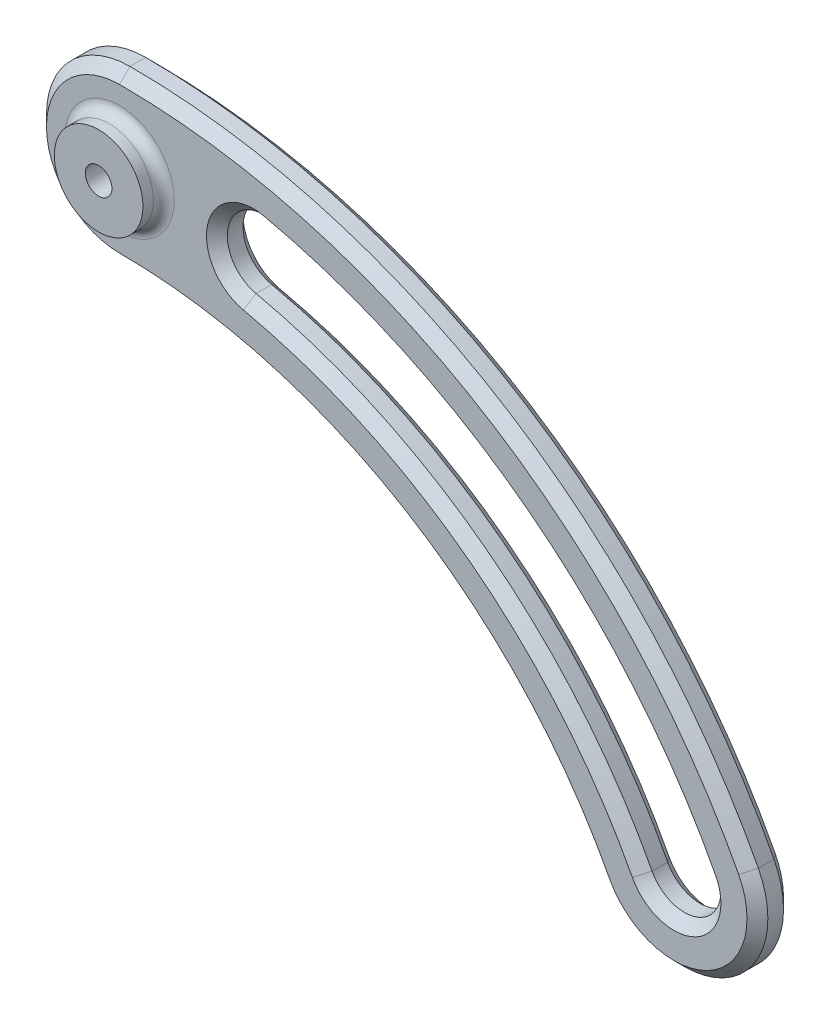
ISO-10303-21;
HEADER;
FILE_DESCRIPTION(('STEP AP214'),'2;1');
FILE_NAME('part.step','',(''),(''),'','','');
FILE_SCHEMA(('AUTOMOTIVE_DESIGN { 1 0 10303 214 1 1 1 1 }'));
ENDSEC;
DATA;
#1=APPLICATION_CONTEXT('core data for automotive mechanical design processes');
#2=APPLICATION_PROTOCOL_DEFINITION('international standard','automotive_design',2000,#1);
#3=PRODUCT_CONTEXT('',#1,'mechanical');
#4=PRODUCT('Part','Part','',(#3));
#5=PRODUCT_RELATED_PRODUCT_CATEGORY('part','',(#4));
#6=PRODUCT_DEFINITION_FORMATION('','',#4);
#7=PRODUCT_DEFINITION_CONTEXT('part definition',#1,'design');
#8=PRODUCT_DEFINITION('design','',#6,#7);
#9=PRODUCT_DEFINITION_SHAPE('','',#8);
#10=(LENGTH_UNIT() NAMED_UNIT(*) SI_UNIT(.MILLI.,.METRE.));
#11=(NAMED_UNIT(*) PLANE_ANGLE_UNIT() SI_UNIT($,.RADIAN.));
#12=(NAMED_UNIT(*) SI_UNIT($,.STERADIAN.) SOLID_ANGLE_UNIT());
#13=UNCERTAINTY_MEASURE_WITH_UNIT(LENGTH_MEASURE(1.E-05),#10,'distance_accuracy_value','');
#14=(GEOMETRIC_REPRESENTATION_CONTEXT(3) GLOBAL_UNCERTAINTY_ASSIGNED_CONTEXT((#13)) GLOBAL_UNIT_ASSIGNED_CONTEXT((#10,
#11,#12)) REPRESENTATION_CONTEXT('',''));
#15=CARTESIAN_POINT('',(0.,0.,0.));
#16=DIRECTION('',(0.,0.,1.));
#17=DIRECTION('',(1.,0.,0.));
#18=AXIS2_PLACEMENT_3D('',#15,#16,#17);
#19=CARTESIAN_POINT('',(0.,0.,7.));
#20=DIRECTION('',(0.,0.,1.));
#21=DIRECTION('',(1.,0.,0.));
#22=AXIS2_PLACEMENT_3D('',#19,#20,#21);
#23=PLANE('',#22);
#24=CARTESIAN_POINT('',(0.,0.,7.));
#25=DIRECTION('',(0.,0.,1.));
#26=DIRECTION('',(1.,0.,0.));
#27=AXIS2_PLACEMENT_3D('',#24,#25,#26);
#28=CIRCLE('',#27,10.5);
#29=CARTESIAN_POINT('',(10.5,0.,7.));
#30=VERTEX_POINT('',#29);
#31=EDGE_CURVE('E12',#30,#30,#28,.F.);
#32=ORIENTED_EDGE('',*,*,#31,.T.);
#33=EDGE_LOOP('',(#32));
#34=FACE_BOUND('',#33,.T.);
#35=CARTESIAN_POINT('',(0.,-120.,7.));
#36=DIRECTION('',(0.,0.,1.));
#37=DIRECTION('',(1.,0.,0.));
#38=AXIS2_PLACEMENT_3D('',#35,#36,#37);
#39=CIRCLE('',#38,134.);
#40=CARTESIAN_POINT('',(118.702367557929,-57.82486078711,7.));
#41=VERTEX_POINT('',#40);
#42=CARTESIAN_POINT('',(0.,13.9999999999999,7.));
#43=VERTEX_POINT('',#42);
#44=EDGE_CURVE('E270',#41,#43,#39,.T.);
#45=ORIENTED_EDGE('',*,*,#44,.T.);
#46=CARTESIAN_POINT('',(0.,0.,7.));
#47=DIRECTION('',(0.,0.,1.));
#48=DIRECTION('',(1.,0.,0.));
#49=AXIS2_PLACEMENT_3D('',#46,#47,#48);
#50=CIRCLE('',#49,13.9999999999999);
#51=CARTESIAN_POINT('',(0.,-13.9999999999999,7.));
#52=VERTEX_POINT('',#51);
#53=EDGE_CURVE('E274',#43,#52,#50,.T.);
#54=ORIENTED_EDGE('',*,*,#53,.T.);
#55=CARTESIAN_POINT('',(0.,-120.,7.));
#56=DIRECTION('',(0.,0.,1.));
#57=DIRECTION('',(1.,0.,0.));
#58=AXIS2_PLACEMENT_3D('',#55,#56,#57);
#59=CIRCLE('',#58,106.);
#60=CARTESIAN_POINT('',(93.8988877697053,-70.8166809211466,7.));
#61=VERTEX_POINT('',#60);
#62=EDGE_CURVE('E272',#52,#61,#59,.F.);
#63=ORIENTED_EDGE('',*,*,#62,.T.);
#64=CARTESIAN_POINT('',(106.300627663817,-64.3207708541283,7.));
#65=DIRECTION('',(0.,0.,1.));
#66=DIRECTION('',(1.,0.,0.));
#67=AXIS2_PLACEMENT_3D('',#64,#65,#66);
#68=CIRCLE('',#67,13.9999999999999);
#69=EDGE_CURVE('E268',#61,#41,#68,.T.);
#70=ORIENTED_EDGE('',*,*,#69,.T.);
#71=EDGE_LOOP('',(#45,#54,#63,#70));
#72=FACE_BOUND('',#71,.T.);
#73=CARTESIAN_POINT('',(106.300627663817,-64.3207708541283,7.));
#74=DIRECTION('',(0.,0.,1.));
#75=DIRECTION('',(1.,0.,0.));
#76=AXIS2_PLACEMENT_3D('',#73,#74,#75);
#77=CIRCLE('',#76,8.99999999999999);
#78=CARTESIAN_POINT('',(114.273174738604,-60.1448286681879,7.));
#79=VERTEX_POINT('',#78);
#80=CARTESIAN_POINT('',(98.328080589031,-68.4967130400687,7.));
#81=VERTEX_POINT('',#80);
#82=EDGE_CURVE('E165',#79,#81,#77,.F.);
#83=ORIENTED_EDGE('',*,*,#82,.T.);
#84=CARTESIAN_POINT('',(0.,-120.,7.));
#85=DIRECTION('',(0.,0.,1.));
#86=DIRECTION('',(1.,0.,0.));
#87=AXIS2_PLACEMENT_3D('',#84,#85,#86);
#88=CIRCLE('',#87,111.);
#89=CARTESIAN_POINT('',(23.7502651088709,-11.5706455462435,7.));
#90=VERTEX_POINT('',#89);
#91=EDGE_CURVE('E161',#81,#90,#88,.T.);
#92=ORIENTED_EDGE('',*,*,#91,.T.);
#93=CARTESIAN_POINT('',(25.6759622798604,-2.77907626620924,7.));
#94=DIRECTION('',(0.,0.,1.));
#95=DIRECTION('',(1.,0.,0.));
#96=AXIS2_PLACEMENT_3D('',#93,#94,#95);
#97=CIRCLE('',#96,9.);
#98=CARTESIAN_POINT('',(27.6016594508499,6.01249301382506,7.));
#99=VERTEX_POINT('',#98);
#100=EDGE_CURVE('E156',#90,#99,#97,.F.);
#101=ORIENTED_EDGE('',*,*,#100,.T.);
#102=CARTESIAN_POINT('',(0.,-120.,7.));
#103=DIRECTION('',(0.,0.,1.));
#104=DIRECTION('',(1.,0.,0.));
#105=AXIS2_PLACEMENT_3D('',#102,#103,#104);
#106=CIRCLE('',#105,129.);
#107=EDGE_CURVE('E158',#99,#79,#106,.F.);
#108=ORIENTED_EDGE('',*,*,#107,.T.);
#109=EDGE_LOOP('',(#83,#92,#101,#108));
#110=FACE_BOUND('',#109,.T.);
#111=ADVANCED_FACE('F40',(#34,#72,#110),#23,.T.);
#112=CARTESIAN_POINT('',(0.,-120.,7.));
#113=DIRECTION('',(0.,0.,-1.));
#114=DIRECTION('',(-1.,0.,0.));
#115=AXIS2_PLACEMENT_3D('',#112,#113,#114);
#116=CYLINDRICAL_SURFACE('',#115,127.);
#117=DIRECTION('',(0.,0.,-1.));
#118=VECTOR('',#117,1.);
#119=CARTESIAN_POINT('',(27.1737267461856,4.05881095159521,7.));
#120=LINE('',#119,#118);
#121=CARTESIAN_POINT('',(27.1737267461856,4.05881095159521,5.));
#122=VERTEX_POINT('',#121);
#123=CARTESIAN_POINT('',(27.1737267461856,4.05881095159521,2.00000000000003));
#124=VERTEX_POINT('',#123);
#125=EDGE_CURVE('E247',#122,#124,#120,.T.);
#126=ORIENTED_EDGE('',*,*,#125,.T.);
#127=CARTESIAN_POINT('',(0.,-120.,2.00000000000003));
#128=DIRECTION('',(0.,0.,1.));
#129=DIRECTION('',(1.,0.,0.));
#130=AXIS2_PLACEMENT_3D('',#127,#128,#129);
#131=CIRCLE('',#130,127.);
#132=CARTESIAN_POINT('',(112.501497610873,-61.0728158206191,2.00000000000003));
#133=VERTEX_POINT('',#132);
#134=EDGE_CURVE('E56',#124,#133,#131,.F.);
#135=ORIENTED_EDGE('',*,*,#134,.T.);
#136=DIRECTION('',(0.,0.,-1.));
#137=VECTOR('',#136,1.);
#138=CARTESIAN_POINT('',(112.501497610873,-61.0728158206191,7.));
#139=LINE('',#138,#137);
#140=CARTESIAN_POINT('',(112.501497610873,-61.0728158206191,5.));
#141=VERTEX_POINT('',#140);
#142=EDGE_CURVE('E176',#141,#133,#139,.T.);
#143=ORIENTED_EDGE('',*,*,#142,.F.);
#144=CARTESIAN_POINT('',(0.,-120.,5.));
#145=DIRECTION('',(0.,0.,1.));
#146=DIRECTION('',(1.,0.,0.));
#147=AXIS2_PLACEMENT_3D('',#144,#145,#146);
#148=CIRCLE('',#147,127.);
#149=EDGE_CURVE('E322',#141,#122,#148,.T.);
#150=ORIENTED_EDGE('',*,*,#149,.T.);
#151=EDGE_LOOP('',(#126,#135,#143,#150));
#152=FACE_BOUND('',#151,.T.);
#153=ADVANCED_FACE('F324',(#152),#116,.F.);
#154=CARTESIAN_POINT('',(106.300627663817,-64.3207708541283,7.));
#155=DIRECTION('',(0.,0.,-1.));
#156=DIRECTION('',(-1.,0.,0.));
#157=AXIS2_PLACEMENT_3D('',#154,#155,#156);
#158=CYLINDRICAL_SURFACE('',#157,6.99999999999999);
#159=ORIENTED_EDGE('',*,*,#142,.T.);
#160=CARTESIAN_POINT('',(106.300627663817,-64.3207708541283,2.00000000000003));
#161=DIRECTION('',(0.,0.,1.));
#162=DIRECTION('',(1.,0.,0.));
#163=AXIS2_PLACEMENT_3D('',#160,#161,#162);
#164=CIRCLE('',#163,6.99999999999999);
#165=CARTESIAN_POINT('',(100.099757716761,-67.5687258876375,2.00000000000003));
#166=VERTEX_POINT('',#165);
#167=EDGE_CURVE('E189',#133,#166,#164,.F.);
#168=ORIENTED_EDGE('',*,*,#167,.T.);
#169=DIRECTION('',(0.,0.,-1.));
#170=VECTOR('',#169,1.);
#171=CARTESIAN_POINT('',(100.099757716761,-67.5687258876375,7.));
#172=LINE('',#171,#170);
#173=CARTESIAN_POINT('',(100.099757716761,-67.5687258876375,5.));
#174=VERTEX_POINT('',#173);
#175=EDGE_CURVE('E253',#174,#166,#172,.T.);
#176=ORIENTED_EDGE('',*,*,#175,.F.);
#177=CARTESIAN_POINT('',(106.300627663817,-64.3207708541283,5.));
#178=DIRECTION('',(0.,0.,1.));
#179=DIRECTION('',(1.,0.,0.));
#180=AXIS2_PLACEMENT_3D('',#177,#178,#179);
#181=CIRCLE('',#180,6.99999999999999);
#182=EDGE_CURVE('E63',#174,#141,#181,.T.);
#183=ORIENTED_EDGE('',*,*,#182,.T.);
#184=EDGE_LOOP('',(#159,#168,#176,#183));
#185=FACE_BOUND('',#184,.T.);
#186=ADVANCED_FACE('F366',(#185),#158,.F.);
#187=CARTESIAN_POINT('',(0.,-120.,7.));
#188=DIRECTION('',(0.,0.,-1.));
#189=DIRECTION('',(-1.,0.,0.));
#190=AXIS2_PLACEMENT_3D('',#187,#188,#189);
#191=CYLINDRICAL_SURFACE('',#190,113.);
#192=ORIENTED_EDGE('',*,*,#175,.T.);
#193=CARTESIAN_POINT('',(0.,-120.,2.00000000000003));
#194=DIRECTION('',(0.,0.,1.));
#195=DIRECTION('',(1.,0.,0.));
#196=AXIS2_PLACEMENT_3D('',#193,#194,#195);
#197=CIRCLE('',#196,113.);
#198=CARTESIAN_POINT('',(24.1781978135352,-9.6169634840137,2.00000000000003));
#199=VERTEX_POINT('',#198);
#200=EDGE_CURVE('E320',#166,#199,#197,.T.);
#201=ORIENTED_EDGE('',*,*,#200,.T.);
#202=DIRECTION('',(0.,0.,-1.));
#203=VECTOR('',#202,1.);
#204=CARTESIAN_POINT('',(24.1781978135352,-9.6169634840137,7.));
#205=LINE('',#204,#203);
#206=CARTESIAN_POINT('',(24.1781978135352,-9.6169634840137,5.));
#207=VERTEX_POINT('',#206);
#208=EDGE_CURVE('E249',#207,#199,#205,.T.);
#209=ORIENTED_EDGE('',*,*,#208,.F.);
#210=CARTESIAN_POINT('',(0.,-120.,5.));
#211=DIRECTION('',(0.,0.,1.));
#212=DIRECTION('',(1.,0.,0.));
#213=AXIS2_PLACEMENT_3D('',#210,#211,#212);
#214=CIRCLE('',#213,113.);
#215=EDGE_CURVE('E317',#207,#174,#214,.F.);
#216=ORIENTED_EDGE('',*,*,#215,.T.);
#217=EDGE_LOOP('',(#192,#201,#209,#216));
#218=FACE_BOUND('',#217,.T.);
#219=ADVANCED_FACE('F385',(#218),#191,.T.);
#220=CARTESIAN_POINT('',(0.,-120.,7.));
#221=DIRECTION('',(0.,0.,-1.));
#222=DIRECTION('',(-1.,0.,0.));
#223=AXIS2_PLACEMENT_3D('',#220,#221,#222);
#224=CYLINDRICAL_SURFACE('',#223,104.);
#225=DIRECTION('',(0.,0.,-1.));
#226=VECTOR('',#225,1.);
#227=CARTESIAN_POINT('',(92.127210641975,-71.7446680735778,7.));
#228=LINE('',#227,#226);
#229=CARTESIAN_POINT('',(92.127210641975,-71.7446680735778,4.99999999999997));
#230=VERTEX_POINT('',#229);
#231=CARTESIAN_POINT('',(92.127210641975,-71.7446680735778,2.00000000000002));
#232=VERTEX_POINT('',#231);
#233=EDGE_CURVE('E250',#230,#232,#228,.T.);
#234=ORIENTED_EDGE('',*,*,#233,.F.);
#235=CARTESIAN_POINT('',(0.,-120.,4.99999999999997));
#236=DIRECTION('',(0.,0.,1.));
#237=DIRECTION('',(1.,0.,0.));
#238=AXIS2_PLACEMENT_3D('',#235,#236,#237);
#239=CIRCLE('',#238,104.);
#240=CARTESIAN_POINT('',(0.,-16.,4.99999999999997));
#241=VERTEX_POINT('',#240);
#242=EDGE_CURVE('E285',#230,#241,#239,.T.);
#243=ORIENTED_EDGE('',*,*,#242,.T.);
#244=DIRECTION('',(0.,0.,-1.));
#245=VECTOR('',#244,1.);
#246=CARTESIAN_POINT('',(0.,-16.,7.));
#247=LINE('',#246,#245);
#248=CARTESIAN_POINT('',(0.,-16.,2.00000000000002));
#249=VERTEX_POINT('',#248);
#250=EDGE_CURVE('E246',#241,#249,#247,.T.);
#251=ORIENTED_EDGE('',*,*,#250,.T.);
#252=CARTESIAN_POINT('',(0.,-120.,2.00000000000002));
#253=DIRECTION('',(0.,0.,1.));
#254=DIRECTION('',(1.,0.,0.));
#255=AXIS2_PLACEMENT_3D('',#252,#253,#254);
#256=CIRCLE('',#255,104.);
#257=EDGE_CURVE('E283',#249,#232,#256,.F.);
#258=ORIENTED_EDGE('',*,*,#257,.T.);
#259=EDGE_LOOP('',(#234,#243,#251,#258));
#260=FACE_BOUND('',#259,.T.);
#261=ADVANCED_FACE('F388',(#260),#224,.F.);
#262=CARTESIAN_POINT('',(106.300627663817,-64.3207708541283,7.));
#263=DIRECTION('',(0.,0.,-1.));
#264=DIRECTION('',(-1.,0.,0.));
#265=AXIS2_PLACEMENT_3D('',#262,#263,#264);
#266=CYLINDRICAL_SURFACE('',#265,16.);
#267=DIRECTION('',(0.,0.,-1.));
#268=VECTOR('',#267,1.);
#269=CARTESIAN_POINT('',(120.47404468566,-56.8968736346787,7.));
#270=LINE('',#269,#268);
#271=CARTESIAN_POINT('',(120.47404468566,-56.8968736346787,4.99999999999997));
#272=VERTEX_POINT('',#271);
#273=CARTESIAN_POINT('',(120.47404468566,-56.8968736346787,2.00000000000002));
#274=VERTEX_POINT('',#273);
#275=EDGE_CURVE('E261',#272,#274,#270,.T.);
#276=ORIENTED_EDGE('',*,*,#275,.F.);
#277=CARTESIAN_POINT('',(106.300627663817,-64.3207708541283,4.99999999999997));
#278=DIRECTION('',(0.,0.,1.));
#279=DIRECTION('',(1.,0.,0.));
#280=AXIS2_PLACEMENT_3D('',#277,#278,#279);
#281=CIRCLE('',#280,16.);
#282=EDGE_CURVE('E293',#272,#230,#281,.F.);
#283=ORIENTED_EDGE('',*,*,#282,.T.);
#284=ORIENTED_EDGE('',*,*,#233,.T.);
#285=CARTESIAN_POINT('',(106.300627663817,-64.3207708541283,2.00000000000002));
#286=DIRECTION('',(0.,0.,1.));
#287=DIRECTION('',(1.,0.,0.));
#288=AXIS2_PLACEMENT_3D('',#285,#286,#287);
#289=CIRCLE('',#288,16.);
#290=EDGE_CURVE('E291',#232,#274,#289,.T.);
#291=ORIENTED_EDGE('',*,*,#290,.T.);
#292=EDGE_LOOP('',(#276,#283,#284,#291));
#293=FACE_BOUND('',#292,.T.);
#294=ADVANCED_FACE('F397',(#293),#266,.T.);
#295=CARTESIAN_POINT('',(0.,-120.,7.));
#296=DIRECTION('',(0.,0.,-1.));
#297=DIRECTION('',(-1.,0.,0.));
#298=AXIS2_PLACEMENT_3D('',#295,#296,#297);
#299=CYLINDRICAL_SURFACE('',#298,136.);
#300=DIRECTION('',(0.,0.,-1.));
#301=VECTOR('',#300,1.);
#302=CARTESIAN_POINT('',(0.,16.,7.));
#303=LINE('',#302,#301);
#304=CARTESIAN_POINT('',(0.,16.,4.99999999999997));
#305=VERTEX_POINT('',#304);
#306=CARTESIAN_POINT('',(0.,16.,2.00000000000002));
#307=VERTEX_POINT('',#306);
#308=EDGE_CURVE('E258',#305,#307,#303,.T.);
#309=ORIENTED_EDGE('',*,*,#308,.F.);
#310=CARTESIAN_POINT('',(0.,-120.,4.99999999999997));
#311=DIRECTION('',(0.,0.,1.));
#312=DIRECTION('',(1.,0.,0.));
#313=AXIS2_PLACEMENT_3D('',#310,#311,#312);
#314=CIRCLE('',#313,136.);
#315=EDGE_CURVE('E289',#305,#272,#314,.F.);
#316=ORIENTED_EDGE('',*,*,#315,.T.);
#317=ORIENTED_EDGE('',*,*,#275,.T.);
#318=CARTESIAN_POINT('',(0.,-120.,2.00000000000002));
#319=DIRECTION('',(0.,0.,1.));
#320=DIRECTION('',(1.,0.,0.));
#321=AXIS2_PLACEMENT_3D('',#318,#319,#320);
#322=CIRCLE('',#321,136.);
#323=EDGE_CURVE('E287',#274,#307,#322,.T.);
#324=ORIENTED_EDGE('',*,*,#323,.T.);
#325=EDGE_LOOP('',(#309,#316,#317,#324));
#326=FACE_BOUND('',#325,.T.);
#327=ADVANCED_FACE('F384',(#326),#299,.T.);
#328=CARTESIAN_POINT('',(25.6759622798604,-2.77907626620924,7.));
#329=DIRECTION('',(0.,0.,-1.));
#330=DIRECTION('',(-1.,0.,0.));
#331=AXIS2_PLACEMENT_3D('',#328,#329,#330);
#332=CYLINDRICAL_SURFACE('',#331,7.);
#333=ORIENTED_EDGE('',*,*,#208,.T.);
#334=CARTESIAN_POINT('',(25.6759622798604,-2.77907626620924,2.00000000000003));
#335=DIRECTION('',(0.,0.,1.));
#336=DIRECTION('',(1.,0.,0.));
#337=AXIS2_PLACEMENT_3D('',#334,#335,#336);
#338=CIRCLE('',#337,7.);
#339=EDGE_CURVE('E314',#199,#124,#338,.F.);
#340=ORIENTED_EDGE('',*,*,#339,.T.);
#341=ORIENTED_EDGE('',*,*,#125,.F.);
#342=CARTESIAN_POINT('',(25.6759622798604,-2.77907626620924,5.));
#343=DIRECTION('',(0.,0.,1.));
#344=DIRECTION('',(1.,0.,0.));
#345=AXIS2_PLACEMENT_3D('',#342,#343,#344);
#346=CIRCLE('',#345,7.);
#347=EDGE_CURVE('E179',#122,#207,#346,.T.);
#348=ORIENTED_EDGE('',*,*,#347,.T.);
#349=EDGE_LOOP('',(#333,#340,#341,#348));
#350=FACE_BOUND('',#349,.T.);
#351=ADVANCED_FACE('F326',(#350),#332,.F.);
#352=CARTESIAN_POINT('',(0.,0.,7.));
#353=DIRECTION('',(0.,0.,-1.));
#354=DIRECTION('',(-1.,0.,0.));
#355=AXIS2_PLACEMENT_3D('',#352,#353,#354);
#356=CYLINDRICAL_SURFACE('',#355,16.);
#357=ORIENTED_EDGE('',*,*,#250,.F.);
#358=CARTESIAN_POINT('',(0.,0.,4.99999999999997));
#359=DIRECTION('',(0.,0.,1.));
#360=DIRECTION('',(1.,0.,0.));
#361=AXIS2_PLACEMENT_3D('',#358,#359,#360);
#362=CIRCLE('',#361,16.);
#363=EDGE_CURVE('E280',#241,#305,#362,.F.);
#364=ORIENTED_EDGE('',*,*,#363,.T.);
#365=ORIENTED_EDGE('',*,*,#308,.T.);
#366=CARTESIAN_POINT('',(0.,0.,2.00000000000002));
#367=DIRECTION('',(0.,0.,1.));
#368=DIRECTION('',(1.,0.,0.));
#369=AXIS2_PLACEMENT_3D('',#366,#367,#368);
#370=CIRCLE('',#369,16.);
#371=EDGE_CURVE('E277',#307,#249,#370,.T.);
#372=ORIENTED_EDGE('',*,*,#371,.T.);
#373=EDGE_LOOP('',(#357,#364,#365,#372));
#374=FACE_BOUND('',#373,.T.);
#375=ADVANCED_FACE('F380',(#374),#356,.T.);
#376=CARTESIAN_POINT('',(0.,0.,7.));
#377=DIRECTION('',(0.,0.,-1.));
#378=DIRECTION('',(-1.,0.,0.));
#379=AXIS2_PLACEMENT_3D('',#376,#377,#378);
#380=CYLINDRICAL_SURFACE('',#379,2.55);
#381=CARTESIAN_POINT('',(0.,0.,2.));
#382=DIRECTION('',(0.,0.,1.));
#383=DIRECTION('',(1.,0.,0.));
#384=AXIS2_PLACEMENT_3D('',#381,#382,#383);
#385=CIRCLE('',#384,2.55);
#386=CARTESIAN_POINT('',(2.55,0.,2.));
#387=VERTEX_POINT('',#386);
#388=EDGE_CURVE('E44',#387,#387,#385,.T.);
#389=ORIENTED_EDGE('',*,*,#388,.F.);
#390=EDGE_LOOP('',(#389));
#391=FACE_BOUND('',#390,.T.);
#392=CARTESIAN_POINT('',(0.,0.,11.));
#393=DIRECTION('',(0.,0.,1.));
#394=DIRECTION('',(1.,0.,0.));
#395=AXIS2_PLACEMENT_3D('',#392,#393,#394);
#396=CIRCLE('',#395,2.55);
#397=CARTESIAN_POINT('',(2.55,0.,11.));
#398=VERTEX_POINT('',#397);
#399=EDGE_CURVE('E209',#398,#398,#396,.T.);
#400=ORIENTED_EDGE('',*,*,#399,.T.);
#401=EDGE_LOOP('',(#400));
#402=FACE_BOUND('',#401,.T.);
#403=ADVANCED_FACE('F376',(#391,#402),#380,.F.);
#404=CARTESIAN_POINT('',(0.,0.,0.));
#405=DIRECTION('',(0.,0.,1.));
#406=DIRECTION('',(1.,0.,0.));
#407=AXIS2_PLACEMENT_3D('',#404,#405,#406);
#408=PLANE('',#407);
#409=CARTESIAN_POINT('',(0.,0.,0.));
#410=DIRECTION('',(0.,0.,1.));
#411=DIRECTION('',(1.,0.,0.));
#412=AXIS2_PLACEMENT_3D('',#409,#410,#411);
#413=CIRCLE('',#412,5.25);
#414=CARTESIAN_POINT('',(5.25,0.,0.));
#415=VERTEX_POINT('',#414);
#416=EDGE_CURVE('E230',#415,#415,#413,.F.);
#417=ORIENTED_EDGE('',*,*,#416,.F.);
#418=EDGE_LOOP('',(#417));
#419=FACE_BOUND('',#418,.T.);
#420=CARTESIAN_POINT('',(0.,-120.,0.));
#421=DIRECTION('',(0.,0.,1.));
#422=DIRECTION('',(1.,0.,0.));
#423=AXIS2_PLACEMENT_3D('',#420,#421,#422);
#424=CIRCLE('',#423,106.);
#425=CARTESIAN_POINT('',(93.8988877697053,-70.8166809211466,0.));
#426=VERTEX_POINT('',#425);
#427=CARTESIAN_POINT('',(0.,-13.9999999999999,0.));
#428=VERTEX_POINT('',#427);
#429=EDGE_CURVE('E308',#426,#428,#424,.T.);
#430=ORIENTED_EDGE('',*,*,#429,.T.);
#431=CARTESIAN_POINT('',(0.,0.,0.));
#432=DIRECTION('',(0.,0.,1.));
#433=DIRECTION('',(1.,0.,0.));
#434=AXIS2_PLACEMENT_3D('',#431,#432,#433);
#435=CIRCLE('',#434,13.9999999999999);
#436=CARTESIAN_POINT('',(0.,13.9999999999999,0.));
#437=VERTEX_POINT('',#436);
#438=EDGE_CURVE('E310',#428,#437,#435,.F.);
#439=ORIENTED_EDGE('',*,*,#438,.T.);
#440=CARTESIAN_POINT('',(0.,-120.,0.));
#441=DIRECTION('',(0.,0.,1.));
#442=DIRECTION('',(1.,0.,0.));
#443=AXIS2_PLACEMENT_3D('',#440,#441,#442);
#444=CIRCLE('',#443,134.);
#445=CARTESIAN_POINT('',(118.702367557929,-57.82486078711,0.));
#446=VERTEX_POINT('',#445);
#447=EDGE_CURVE('E306',#437,#446,#444,.F.);
#448=ORIENTED_EDGE('',*,*,#447,.T.);
#449=CARTESIAN_POINT('',(106.300627663817,-64.3207708541283,0.));
#450=DIRECTION('',(0.,0.,1.));
#451=DIRECTION('',(1.,0.,0.));
#452=AXIS2_PLACEMENT_3D('',#449,#450,#451);
#453=CIRCLE('',#452,13.9999999999999);
#454=EDGE_CURVE('E304',#446,#426,#453,.F.);
#455=ORIENTED_EDGE('',*,*,#454,.T.);
#456=EDGE_LOOP('',(#430,#439,#448,#455));
#457=FACE_BOUND('',#456,.T.);
#458=CARTESIAN_POINT('',(0.,-120.,0.));
#459=DIRECTION('',(0.,0.,1.));
#460=DIRECTION('',(1.,0.,0.));
#461=AXIS2_PLACEMENT_3D('',#458,#459,#460);
#462=CIRCLE('',#461,129.);
#463=CARTESIAN_POINT('',(114.273174738604,-60.1448286681879,0.));
#464=VERTEX_POINT('',#463);
#465=CARTESIAN_POINT('',(27.60165945085,6.01249301382509,0.));
#466=VERTEX_POINT('',#465);
#467=EDGE_CURVE('E297',#464,#466,#462,.T.);
#468=ORIENTED_EDGE('',*,*,#467,.T.);
#469=CARTESIAN_POINT('',(25.6759622798604,-2.77907626620924,0.));
#470=DIRECTION('',(0.,0.,1.));
#471=DIRECTION('',(1.,0.,0.));
#472=AXIS2_PLACEMENT_3D('',#469,#470,#471);
#473=CIRCLE('',#472,9.00000000000003);
#474=CARTESIAN_POINT('',(23.7502651088709,-11.5706455462436,0.));
#475=VERTEX_POINT('',#474);
#476=EDGE_CURVE('E301',#466,#475,#473,.T.);
#477=ORIENTED_EDGE('',*,*,#476,.T.);
#478=CARTESIAN_POINT('',(0.,-120.,0.));
#479=DIRECTION('',(0.,0.,1.));
#480=DIRECTION('',(1.,0.,0.));
#481=AXIS2_PLACEMENT_3D('',#478,#479,#480);
#482=CIRCLE('',#481,111.);
#483=CARTESIAN_POINT('',(98.3280805890309,-68.4967130400687,0.));
#484=VERTEX_POINT('',#483);
#485=EDGE_CURVE('E299',#475,#484,#482,.F.);
#486=ORIENTED_EDGE('',*,*,#485,.T.);
#487=CARTESIAN_POINT('',(106.300627663817,-64.3207708541283,0.));
#488=DIRECTION('',(0.,0.,1.));
#489=DIRECTION('',(1.,0.,0.));
#490=AXIS2_PLACEMENT_3D('',#487,#488,#489);
#491=CIRCLE('',#490,9.00000000000002);
#492=EDGE_CURVE('E295',#484,#464,#491,.T.);
#493=ORIENTED_EDGE('',*,*,#492,.T.);
#494=EDGE_LOOP('',(#468,#477,#486,#493));
#495=FACE_BOUND('',#494,.T.);
#496=ADVANCED_FACE('F341',(#419,#457,#495),#408,.F.);
#497=CARTESIAN_POINT('',(0.,0.,11.));
#498=DIRECTION('',(0.,0.,1.));
#499=DIRECTION('',(1.,0.,0.));
#500=AXIS2_PLACEMENT_3D('',#497,#498,#499);
#501=PLANE('',#500);
#502=CARTESIAN_POINT('',(0.,0.,11.));
#503=DIRECTION('',(0.,0.,1.));
#504=DIRECTION('',(1.,0.,0.));
#505=AXIS2_PLACEMENT_3D('',#502,#503,#504);
#506=CIRCLE('',#505,8.5);
#507=CARTESIAN_POINT('',(8.5,0.,11.));
#508=VERTEX_POINT('',#507);
#509=EDGE_CURVE('E243',#508,#508,#506,.T.);
#510=ORIENTED_EDGE('',*,*,#509,.T.);
#511=EDGE_LOOP('',(#510));
#512=FACE_BOUND('',#511,.T.);
#513=ORIENTED_EDGE('',*,*,#399,.F.);
#514=EDGE_LOOP('',(#513));
#515=FACE_BOUND('',#514,.T.);
#516=ADVANCED_FACE('F375',(#512,#515),#501,.T.);
#517=CARTESIAN_POINT('',(0.,0.,11.));
#518=DIRECTION('',(0.,0.,-1.));
#519=DIRECTION('',(-1.,0.,0.));
#520=AXIS2_PLACEMENT_3D('',#517,#518,#519);
#521=CYLINDRICAL_SURFACE('',#520,8.5);
#522=CARTESIAN_POINT('',(0.,0.,9.));
#523=DIRECTION('',(0.,0.,1.));
#524=DIRECTION('',(1.,0.,0.));
#525=AXIS2_PLACEMENT_3D('',#522,#523,#524);
#526=CIRCLE('',#525,8.5);
#527=CARTESIAN_POINT('',(8.5,0.,9.));
#528=VERTEX_POINT('',#527);
#529=EDGE_CURVE('E49',#528,#528,#526,.T.);
#530=ORIENTED_EDGE('',*,*,#529,.T.);
#531=EDGE_LOOP('',(#530));
#532=FACE_BOUND('',#531,.T.);
#533=ORIENTED_EDGE('',*,*,#509,.F.);
#534=EDGE_LOOP('',(#533));
#535=FACE_BOUND('',#534,.T.);
#536=ADVANCED_FACE('F371',(#532,#535),#521,.T.);
#537=CARTESIAN_POINT('',(106.300627663817,-64.3207708541283,7.));
#538=DIRECTION('',(0.,0.,-1.));
#539=DIRECTION('',(-1.,0.,0.));
#540=AXIS2_PLACEMENT_3D('',#537,#538,#539);
#541=CONICAL_SURFACE('',#540,13.9999999999999,0.78539816339745);
#542=DIRECTION('',(0.626382455545601,0.328093004169045,0.707106781186543));
#543=VECTOR('',#542,1.);
#544=CARTESIAN_POINT('',(92.127210641975,-71.7446680735778,4.99999999999997));
#545=LINE('',#544,#543);
#546=EDGE_CURVE('E203',#230,#61,#545,.T.);
#547=ORIENTED_EDGE('',*,*,#546,.F.);
#548=ORIENTED_EDGE('',*,*,#282,.F.);
#549=DIRECTION('',(0.626382455545598,0.328093004169046,-0.707106781186545));
#550=VECTOR('',#549,1.);
#551=CARTESIAN_POINT('',(118.702367557929,-57.82486078711,7.));
#552=LINE('',#551,#550);
#553=EDGE_CURVE('E206',#41,#272,#552,.T.);
#554=ORIENTED_EDGE('',*,*,#553,.F.);
#555=ORIENTED_EDGE('',*,*,#69,.F.);
#556=EDGE_LOOP('',(#547,#548,#554,#555));
#557=FACE_BOUND('',#556,.T.);
#558=ADVANCED_FACE('F417',(#557),#541,.T.);
#559=CARTESIAN_POINT('',(0.,-120.,7.));
#560=DIRECTION('',(0.,0.,-1.));
#561=DIRECTION('',(-1.,0.,0.));
#562=AXIS2_PLACEMENT_3D('',#559,#560,#561);
#563=CONICAL_SURFACE('',#562,134.,0.785398163397448);
#564=ORIENTED_EDGE('',*,*,#553,.T.);
#565=ORIENTED_EDGE('',*,*,#315,.F.);
#566=DIRECTION('',(0.,0.70710678118655,-0.707106781186545));
#567=VECTOR('',#566,1.);
#568=CARTESIAN_POINT('',(0.,13.9999999999999,7.));
#569=LINE('',#568,#567);
#570=EDGE_CURVE('E200',#43,#305,#569,.T.);
#571=ORIENTED_EDGE('',*,*,#570,.F.);
#572=ORIENTED_EDGE('',*,*,#44,.F.);
#573=EDGE_LOOP('',(#564,#565,#571,#572));
#574=FACE_BOUND('',#573,.T.);
#575=ADVANCED_FACE('F413',(#574),#563,.T.);
#576=CARTESIAN_POINT('',(0.,-120.,4.99999999999997));
#577=DIRECTION('',(0.,0.,1.));
#578=DIRECTION('',(1.,0.,0.));
#579=AXIS2_PLACEMENT_3D('',#576,#577,#578);
#580=CONICAL_SURFACE('',#579,104.,0.785398163397448);
#581=ORIENTED_EDGE('',*,*,#546,.T.);
#582=ORIENTED_EDGE('',*,*,#62,.F.);
#583=DIRECTION('',(0.,0.707106781186547,0.707106781186548));
#584=VECTOR('',#583,1.);
#585=CARTESIAN_POINT('',(0.,-16.,4.99999999999997));
#586=LINE('',#585,#584);
#587=EDGE_CURVE('E198',#241,#52,#586,.T.);
#588=ORIENTED_EDGE('',*,*,#587,.F.);
#589=ORIENTED_EDGE('',*,*,#242,.F.);
#590=EDGE_LOOP('',(#581,#582,#588,#589));
#591=FACE_BOUND('',#590,.T.);
#592=ADVANCED_FACE('F409',(#591),#580,.F.);
#593=CARTESIAN_POINT('',(0.,0.,7.));
#594=DIRECTION('',(0.,0.,-1.));
#595=DIRECTION('',(-1.,0.,0.));
#596=AXIS2_PLACEMENT_3D('',#593,#594,#595);
#597=CONICAL_SURFACE('',#596,13.9999999999999,0.785398163397451);
#598=ORIENTED_EDGE('',*,*,#570,.T.);
#599=ORIENTED_EDGE('',*,*,#363,.F.);
#600=ORIENTED_EDGE('',*,*,#587,.T.);
#601=ORIENTED_EDGE('',*,*,#53,.F.);
#602=EDGE_LOOP('',(#598,#599,#600,#601));
#603=FACE_BOUND('',#602,.T.);
#604=ADVANCED_FACE('F405',(#603),#597,.T.);
#605=CARTESIAN_POINT('',(106.300627663817,-64.3207708541283,2.00000000000002));
#606=DIRECTION('',(0.,0.,1.));
#607=DIRECTION('',(1.,0.,0.));
#608=AXIS2_PLACEMENT_3D('',#605,#606,#607);
#609=CONICAL_SURFACE('',#608,16.,0.785398163397452);
#610=DIRECTION('',(-0.6263824555456,-0.328093004169047,0.707106781186543));
#611=VECTOR('',#610,1.);
#612=CARTESIAN_POINT('',(93.8988877697053,-70.8166809211466,0.));
#613=LINE('',#612,#611);
#614=EDGE_CURVE('E215',#426,#232,#613,.T.);
#615=ORIENTED_EDGE('',*,*,#614,.F.);
#616=ORIENTED_EDGE('',*,*,#454,.F.);
#617=DIRECTION('',(-0.626382455545597,-0.328093004169048,-0.707106781186546));
#618=VECTOR('',#617,1.);
#619=CARTESIAN_POINT('',(120.47404468566,-56.8968736346787,2.00000000000002));
#620=LINE('',#619,#618);
#621=EDGE_CURVE('E201',#274,#446,#620,.T.);
#622=ORIENTED_EDGE('',*,*,#621,.F.);
#623=ORIENTED_EDGE('',*,*,#290,.F.);
#624=EDGE_LOOP('',(#615,#616,#622,#623));
#625=FACE_BOUND('',#624,.T.);
#626=ADVANCED_FACE('F408',(#625),#609,.T.);
#627=CARTESIAN_POINT('',(0.,-120.,2.00000000000002));
#628=DIRECTION('',(0.,0.,1.));
#629=DIRECTION('',(1.,0.,0.));
#630=AXIS2_PLACEMENT_3D('',#627,#628,#629);
#631=CONICAL_SURFACE('',#630,136.,0.785398163397451);
#632=ORIENTED_EDGE('',*,*,#621,.T.);
#633=ORIENTED_EDGE('',*,*,#447,.F.);
#634=DIRECTION('',(0.,-0.707106781186549,-0.707106781186546));
#635=VECTOR('',#634,1.);
#636=CARTESIAN_POINT('',(0.,16.,2.00000000000002));
#637=LINE('',#636,#635);
#638=EDGE_CURVE('E212',#307,#437,#637,.T.);
#639=ORIENTED_EDGE('',*,*,#638,.F.);
#640=ORIENTED_EDGE('',*,*,#323,.F.);
#641=EDGE_LOOP('',(#632,#633,#639,#640));
#642=FACE_BOUND('',#641,.T.);
#643=ADVANCED_FACE('F424',(#642),#631,.T.);
#644=CARTESIAN_POINT('',(0.,-120.,0.));
#645=DIRECTION('',(0.,0.,-1.));
#646=DIRECTION('',(-1.,0.,0.));
#647=AXIS2_PLACEMENT_3D('',#644,#645,#646);
#648=CONICAL_SURFACE('',#647,106.,0.785398163397454);
#649=ORIENTED_EDGE('',*,*,#614,.T.);
#650=ORIENTED_EDGE('',*,*,#257,.F.);
#651=DIRECTION('',(0.,-0.707106781186549,0.707106781186546));
#652=VECTOR('',#651,1.);
#653=CARTESIAN_POINT('',(0.,-13.9999999999999,0.));
#654=LINE('',#653,#652);
#655=EDGE_CURVE('E210',#428,#249,#654,.T.);
#656=ORIENTED_EDGE('',*,*,#655,.F.);
#657=ORIENTED_EDGE('',*,*,#429,.F.);
#658=EDGE_LOOP('',(#649,#650,#656,#657));
#659=FACE_BOUND('',#658,.T.);
#660=ADVANCED_FACE('F356',(#659),#648,.F.);
#661=CARTESIAN_POINT('',(0.,0.,2.00000000000002));
#662=DIRECTION('',(0.,0.,1.));
#663=DIRECTION('',(1.,0.,0.));
#664=AXIS2_PLACEMENT_3D('',#661,#662,#663);
#665=CONICAL_SURFACE('',#664,16.,0.785398163397451);
#666=ORIENTED_EDGE('',*,*,#638,.T.);
#667=ORIENTED_EDGE('',*,*,#438,.F.);
#668=ORIENTED_EDGE('',*,*,#655,.T.);
#669=ORIENTED_EDGE('',*,*,#371,.F.);
#670=EDGE_LOOP('',(#666,#667,#668,#669));
#671=FACE_BOUND('',#670,.T.);
#672=ADVANCED_FACE('F349',(#671),#665,.T.);
#673=CARTESIAN_POINT('',(106.300627663817,-64.3207708541283,0.));
#674=DIRECTION('',(0.,0.,-1.));
#675=DIRECTION('',(-1.,0.,0.));
#676=AXIS2_PLACEMENT_3D('',#673,#674,#675);
#677=CONICAL_SURFACE('',#676,9.00000000000002,0.78539816339745);
#678=DIRECTION('',(-0.626382455545596,-0.328093004169047,-0.707106781186547));
#679=VECTOR('',#678,1.);
#680=CARTESIAN_POINT('',(100.099757716761,-67.5687258876375,2.00000000000003));
#681=LINE('',#680,#679);
#682=EDGE_CURVE('E223',#166,#484,#681,.T.);
#683=ORIENTED_EDGE('',*,*,#682,.F.);
#684=ORIENTED_EDGE('',*,*,#167,.F.);
#685=DIRECTION('',(-0.626382455545596,-0.328093004169047,0.707106781186547));
#686=VECTOR('',#685,1.);
#687=CARTESIAN_POINT('',(114.273174738604,-60.1448286681879,0.));
#688=LINE('',#687,#686);
#689=EDGE_CURVE('E213',#464,#133,#688,.T.);
#690=ORIENTED_EDGE('',*,*,#689,.F.);
#691=ORIENTED_EDGE('',*,*,#492,.F.);
#692=EDGE_LOOP('',(#683,#684,#690,#691));
#693=FACE_BOUND('',#692,.T.);
#694=ADVANCED_FACE('F347',(#693),#677,.F.);
#695=CARTESIAN_POINT('',(0.,-120.,0.));
#696=DIRECTION('',(0.,0.,-1.));
#697=DIRECTION('',(-1.,0.,0.));
#698=AXIS2_PLACEMENT_3D('',#695,#696,#697);
#699=CONICAL_SURFACE('',#698,129.,0.785398163397456);
#700=ORIENTED_EDGE('',*,*,#689,.T.);
#701=ORIENTED_EDGE('',*,*,#134,.F.);
#702=DIRECTION('',(-0.151297058679829,-0.690730917242626,0.707106781186542));
#703=VECTOR('',#702,1.);
#704=CARTESIAN_POINT('',(27.60165945085,6.01249301382509,0.));
#705=LINE('',#704,#703);
#706=EDGE_CURVE('E221',#466,#124,#705,.T.);
#707=ORIENTED_EDGE('',*,*,#706,.F.);
#708=ORIENTED_EDGE('',*,*,#467,.F.);
#709=EDGE_LOOP('',(#700,#701,#707,#708));
#710=FACE_BOUND('',#709,.T.);
#711=ADVANCED_FACE('F345',(#710),#699,.F.);
#712=CARTESIAN_POINT('',(0.,-120.,2.00000000000003));
#713=DIRECTION('',(0.,0.,1.));
#714=DIRECTION('',(1.,0.,0.));
#715=AXIS2_PLACEMENT_3D('',#712,#713,#714);
#716=CONICAL_SURFACE('',#715,113.,0.785398163397449);
#717=ORIENTED_EDGE('',*,*,#682,.T.);
#718=ORIENTED_EDGE('',*,*,#485,.F.);
#719=DIRECTION('',(-0.151297058679828,-0.690730917242621,-0.707106781186547));
#720=VECTOR('',#719,1.);
#721=CARTESIAN_POINT('',(24.1781978135352,-9.6169634840137,2.00000000000003));
#722=LINE('',#721,#720);
#723=EDGE_CURVE('E182',#199,#475,#722,.T.);
#724=ORIENTED_EDGE('',*,*,#723,.F.);
#725=ORIENTED_EDGE('',*,*,#200,.F.);
#726=EDGE_LOOP('',(#717,#718,#724,#725));
#727=FACE_BOUND('',#726,.T.);
#728=ADVANCED_FACE('F337',(#727),#716,.T.);
#729=CARTESIAN_POINT('',(25.6759622798604,-2.77907626620924,0.));
#730=DIRECTION('',(0.,0.,-1.));
#731=DIRECTION('',(-1.,0.,0.));
#732=AXIS2_PLACEMENT_3D('',#729,#730,#731);
#733=CONICAL_SURFACE('',#732,9.00000000000003,0.785398163397449);
#734=ORIENTED_EDGE('',*,*,#706,.T.);
#735=ORIENTED_EDGE('',*,*,#339,.F.);
#736=ORIENTED_EDGE('',*,*,#723,.T.);
#737=ORIENTED_EDGE('',*,*,#476,.F.);
#738=EDGE_LOOP('',(#734,#735,#736,#737));
#739=FACE_BOUND('',#738,.T.);
#740=ADVANCED_FACE('F331',(#739),#733,.F.);
#741=CARTESIAN_POINT('',(0.,-120.,5.));
#742=DIRECTION('',(0.,0.,1.));
#743=DIRECTION('',(1.,0.,0.));
#744=AXIS2_PLACEMENT_3D('',#741,#742,#743);
#745=CONICAL_SURFACE('',#744,127.,0.785398163397448);
#746=DIRECTION('',(0.151297058679829,0.690730917242626,0.707106781186543));
#747=VECTOR('',#746,1.);
#748=CARTESIAN_POINT('',(27.1737267461856,4.05881095159519,5.));
#749=LINE('',#748,#747);
#750=EDGE_CURVE('E171',#122,#99,#749,.T.);
#751=ORIENTED_EDGE('',*,*,#750,.F.);
#752=ORIENTED_EDGE('',*,*,#149,.F.);
#753=DIRECTION('',(-0.626382455545599,-0.32809300416905,-0.707106781186543));
#754=VECTOR('',#753,1.);
#755=CARTESIAN_POINT('',(114.273174738604,-60.1448286681879,7.));
#756=LINE('',#755,#754);
#757=EDGE_CURVE('E174',#79,#141,#756,.T.);
#758=ORIENTED_EDGE('',*,*,#757,.F.);
#759=ORIENTED_EDGE('',*,*,#107,.F.);
#760=EDGE_LOOP('',(#751,#752,#758,#759));
#761=FACE_BOUND('',#760,.T.);
#762=ADVANCED_FACE('F169',(#761),#745,.F.);
#763=CARTESIAN_POINT('',(106.300627663817,-64.3207708541283,5.));
#764=DIRECTION('',(0.,0.,1.));
#765=DIRECTION('',(1.,0.,0.));
#766=AXIS2_PLACEMENT_3D('',#763,#764,#765);
#767=CONICAL_SURFACE('',#766,6.99999999999999,0.785398163397447);
#768=ORIENTED_EDGE('',*,*,#757,.T.);
#769=ORIENTED_EDGE('',*,*,#182,.F.);
#770=DIRECTION('',(0.626382455545594,0.328093004169047,-0.707106781186548));
#771=VECTOR('',#770,1.);
#772=CARTESIAN_POINT('',(98.328080589031,-68.4967130400687,7.));
#773=LINE('',#772,#771);
#774=EDGE_CURVE('E180',#81,#174,#773,.T.);
#775=ORIENTED_EDGE('',*,*,#774,.F.);
#776=ORIENTED_EDGE('',*,*,#82,.F.);
#777=EDGE_LOOP('',(#768,#769,#775,#776));
#778=FACE_BOUND('',#777,.T.);
#779=ADVANCED_FACE('F449',(#778),#767,.F.);
#780=CARTESIAN_POINT('',(25.6759622798604,-2.77907626620924,5.));
#781=DIRECTION('',(0.,0.,1.));
#782=DIRECTION('',(1.,0.,0.));
#783=AXIS2_PLACEMENT_3D('',#780,#781,#782);
#784=CONICAL_SURFACE('',#783,7.,0.785398163397448);
#785=ORIENTED_EDGE('',*,*,#750,.T.);
#786=ORIENTED_EDGE('',*,*,#100,.F.);
#787=DIRECTION('',(-0.151297058679827,-0.690730917242621,0.707106781186548));
#788=VECTOR('',#787,1.);
#789=CARTESIAN_POINT('',(24.1781978135352,-9.6169634840137,5.));
#790=LINE('',#789,#788);
#791=EDGE_CURVE('E184',#207,#90,#790,.T.);
#792=ORIENTED_EDGE('',*,*,#791,.F.);
#793=ORIENTED_EDGE('',*,*,#347,.F.);
#794=EDGE_LOOP('',(#785,#786,#792,#793));
#795=FACE_BOUND('',#794,.T.);
#796=ADVANCED_FACE('F178',(#795),#784,.F.);
#797=CARTESIAN_POINT('',(0.,-120.,7.));
#798=DIRECTION('',(0.,0.,-1.));
#799=DIRECTION('',(-1.,0.,0.));
#800=AXIS2_PLACEMENT_3D('',#797,#798,#799);
#801=CONICAL_SURFACE('',#800,111.,0.785398163397445);
#802=ORIENTED_EDGE('',*,*,#774,.T.);
#803=ORIENTED_EDGE('',*,*,#215,.F.);
#804=ORIENTED_EDGE('',*,*,#791,.T.);
#805=ORIENTED_EDGE('',*,*,#91,.F.);
#806=EDGE_LOOP('',(#802,#803,#804,#805));
#807=FACE_BOUND('',#806,.T.);
#808=ADVANCED_FACE('F462',(#807),#801,.T.);
#809=CARTESIAN_POINT('',(0.,0.,9.));
#810=DIRECTION('',(0.,0.,1.));
#811=DIRECTION('',(1.,0.,0.));
#812=AXIS2_PLACEMENT_3D('',#809,#810,#811);
#813=TOROIDAL_SURFACE('',#812,10.5,2.);
#814=ORIENTED_EDGE('',*,*,#31,.F.);
#815=EDGE_LOOP('',(#814));
#816=FACE_BOUND('',#815,.T.);
#817=ORIENTED_EDGE('',*,*,#529,.F.);
#818=EDGE_LOOP('',(#817));
#819=FACE_BOUND('',#818,.T.);
#820=ADVANCED_FACE('F42',(#816,#819),#813,.F.);
#821=CARTESIAN_POINT('',(0.,0.,-14.8492424049175));
#822=DIRECTION('',(0.,0.,1.));
#823=DIRECTION('',(1.,0.,0.));
#824=AXIS2_PLACEMENT_3D('',#821,#822,#823);
#825=CYLINDRICAL_SURFACE('',#824,5.25);
#826=ORIENTED_EDGE('',*,*,#416,.T.);
#827=EDGE_LOOP('',(#826));
#828=FACE_BOUND('',#827,.T.);
#829=CARTESIAN_POINT('',(0.,0.,2.));
#830=DIRECTION('',(0.,0.,1.));
#831=DIRECTION('',(1.,0.,0.));
#832=AXIS2_PLACEMENT_3D('',#829,#830,#831);
#833=CIRCLE('',#832,5.25);
#834=CARTESIAN_POINT('',(5.25,0.,2.));
#835=VERTEX_POINT('',#834);
#836=EDGE_CURVE('E234',#835,#835,#833,.T.);
#837=ORIENTED_EDGE('',*,*,#836,.T.);
#838=EDGE_LOOP('',(#837));
#839=FACE_BOUND('',#838,.T.);
#840=ADVANCED_FACE('F474',(#828,#839),#825,.F.);
#841=CARTESIAN_POINT('',(0.,0.,2.));
#842=DIRECTION('',(0.,0.,1.));
#843=DIRECTION('',(1.,0.,0.));
#844=AXIS2_PLACEMENT_3D('',#841,#842,#843);
#845=PLANE('',#844);
#846=ORIENTED_EDGE('',*,*,#388,.T.);
#847=EDGE_LOOP('',(#846));
#848=FACE_BOUND('',#847,.T.);
#849=ORIENTED_EDGE('',*,*,#836,.F.);
#850=EDGE_LOOP('',(#849));
#851=FACE_BOUND('',#850,.T.);
#852=ADVANCED_FACE('F483',(#848,#851),#845,.F.);
#853=CLOSED_SHELL('',(#111,#153,#186,#219,#261,#294,#327,#351,#375,#403,#496,#516,#536,#558,
#575,#592,#604,#626,#643,#660,#672,#694,#711,#728,#740,#762,#779,#796,#808,#820,#840,#852));
#854=MANIFOLD_SOLID_BREP('B2',#853);
#855=ADVANCED_BREP_SHAPE_REPRESENTATION('',(#18,#854),#14);
#856=SHAPE_DEFINITION_REPRESENTATION(#9,#855);
ENDSEC;
END-ISO-10303-21;
